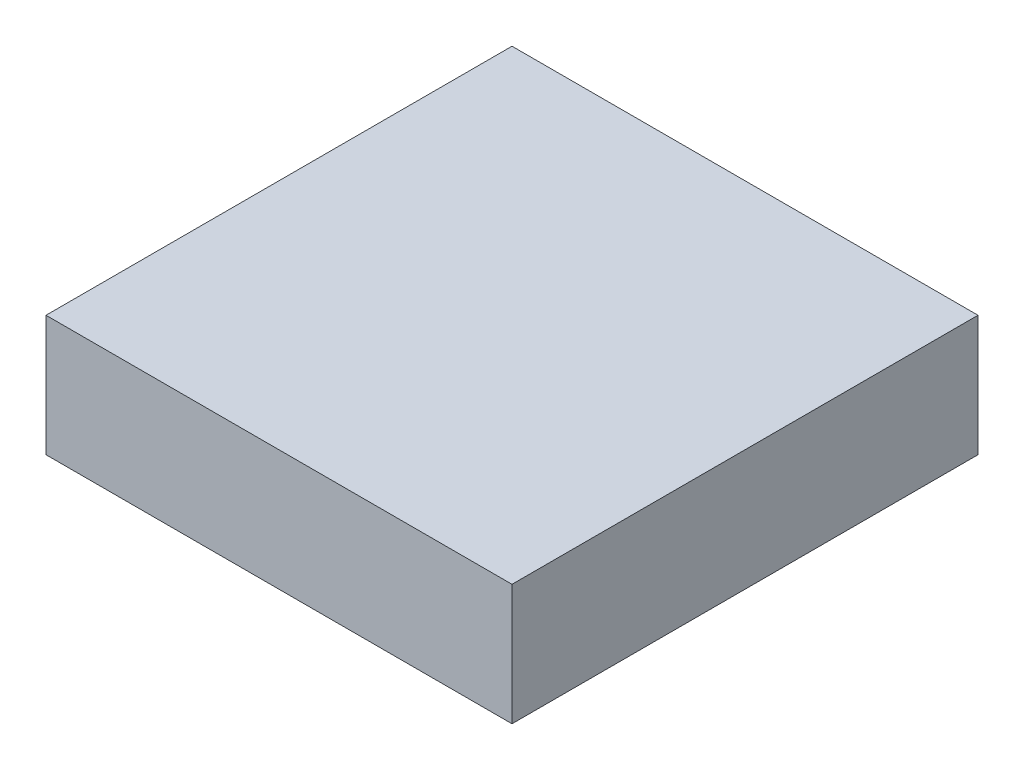
ISO-10303-21;
HEADER;
FILE_DESCRIPTION(('STEP AP214'),'2;1');
FILE_NAME('part.step','',(''),(''),'','','');
FILE_SCHEMA(('AUTOMOTIVE_DESIGN { 1 0 10303 214 1 1 1 1 }'));
ENDSEC;
DATA;
#1=APPLICATION_CONTEXT('core data for automotive mechanical design processes');
#2=APPLICATION_PROTOCOL_DEFINITION('international standard','automotive_design',2000,#1);
#3=PRODUCT_CONTEXT('',#1,'mechanical');
#4=PRODUCT('Part','Part','',(#3));
#5=PRODUCT_RELATED_PRODUCT_CATEGORY('part','',(#4));
#6=PRODUCT_DEFINITION_FORMATION('','',#4);
#7=PRODUCT_DEFINITION_CONTEXT('part definition',#1,'design');
#8=PRODUCT_DEFINITION('design','',#6,#7);
#9=PRODUCT_DEFINITION_SHAPE('','',#8);
#10=(LENGTH_UNIT() NAMED_UNIT(*) SI_UNIT(.MILLI.,.METRE.));
#11=(NAMED_UNIT(*) PLANE_ANGLE_UNIT() SI_UNIT($,.RADIAN.));
#12=(NAMED_UNIT(*) SI_UNIT($,.STERADIAN.) SOLID_ANGLE_UNIT());
#13=UNCERTAINTY_MEASURE_WITH_UNIT(LENGTH_MEASURE(1.E-05),#10,'distance_accuracy_value','');
#14=(GEOMETRIC_REPRESENTATION_CONTEXT(3) GLOBAL_UNCERTAINTY_ASSIGNED_CONTEXT((#13)) GLOBAL_UNIT_ASSIGNED_CONTEXT((#10,
#11,#12)) REPRESENTATION_CONTEXT('',''));
#15=CARTESIAN_POINT('',(0.,0.,0.));
#16=DIRECTION('',(0.,0.,1.));
#17=DIRECTION('',(1.,0.,0.));
#18=AXIS2_PLACEMENT_3D('',#15,#16,#17);
#19=CARTESIAN_POINT('',(0.,7.,0.));
#20=DIRECTION('',(1.,0.,0.));
#21=DIRECTION('',(0.,0.,-1.));
#22=AXIS2_PLACEMENT_3D('',#19,#20,#21);
#23=PLANE('',#22);
#24=DIRECTION('',(0.,0.,1.));
#25=VECTOR('',#24,1.);
#26=CARTESIAN_POINT('',(0.,0.,0.));
#27=LINE('',#26,#25);
#28=CARTESIAN_POINT('',(0.,0.,-27.));
#29=VERTEX_POINT('',#28);
#30=CARTESIAN_POINT('',(0.,0.,0.));
#31=VERTEX_POINT('',#30);
#32=EDGE_CURVE('E97',#29,#31,#27,.T.);
#33=ORIENTED_EDGE('',*,*,#32,.T.);
#34=DIRECTION('',(0.,-1.,0.));
#35=VECTOR('',#34,1.);
#36=CARTESIAN_POINT('',(0.,7.,0.));
#37=LINE('',#36,#35);
#38=CARTESIAN_POINT('',(0.,7.,0.));
#39=VERTEX_POINT('',#38);
#40=EDGE_CURVE('E11',#39,#31,#37,.T.);
#41=ORIENTED_EDGE('',*,*,#40,.F.);
#42=DIRECTION('',(0.,0.,1.));
#43=VECTOR('',#42,1.);
#44=CARTESIAN_POINT('',(0.,7.,0.));
#45=LINE('',#44,#43);
#46=CARTESIAN_POINT('',(0.,7.,-27.));
#47=VERTEX_POINT('',#46);
#48=EDGE_CURVE('E85',#47,#39,#45,.T.);
#49=ORIENTED_EDGE('',*,*,#48,.F.);
#50=DIRECTION('',(0.,-1.,0.));
#51=VECTOR('',#50,1.);
#52=CARTESIAN_POINT('',(0.,7.,-27.));
#53=LINE('',#52,#51);
#54=EDGE_CURVE('E93',#47,#29,#53,.T.);
#55=ORIENTED_EDGE('',*,*,#54,.T.);
#56=EDGE_LOOP('',(#33,#41,#49,#55));
#57=FACE_BOUND('',#56,.T.);
#58=ADVANCED_FACE('F34',(#57),#23,.F.);
#59=CARTESIAN_POINT('',(0.,7.,0.));
#60=DIRECTION('',(0.,0.,-1.));
#61=DIRECTION('',(-1.,0.,0.));
#62=AXIS2_PLACEMENT_3D('',#59,#60,#61);
#63=PLANE('',#62);
#64=DIRECTION('',(1.,0.,0.));
#65=VECTOR('',#64,1.);
#66=CARTESIAN_POINT('',(0.,0.,0.));
#67=LINE('',#66,#65);
#68=CARTESIAN_POINT('',(27.,0.,0.));
#69=VERTEX_POINT('',#68);
#70=EDGE_CURVE('E89',#31,#69,#67,.T.);
#71=ORIENTED_EDGE('',*,*,#70,.T.);
#72=DIRECTION('',(0.,-1.,0.));
#73=VECTOR('',#72,1.);
#74=CARTESIAN_POINT('',(27.,7.,0.));
#75=LINE('',#74,#73);
#76=CARTESIAN_POINT('',(27.,7.,0.));
#77=VERTEX_POINT('',#76);
#78=EDGE_CURVE('E42',#77,#69,#75,.T.);
#79=ORIENTED_EDGE('',*,*,#78,.F.);
#80=DIRECTION('',(1.,0.,0.));
#81=VECTOR('',#80,1.);
#82=CARTESIAN_POINT('',(0.,7.,0.));
#83=LINE('',#82,#81);
#84=EDGE_CURVE('E80',#39,#77,#83,.T.);
#85=ORIENTED_EDGE('',*,*,#84,.F.);
#86=ORIENTED_EDGE('',*,*,#40,.T.);
#87=EDGE_LOOP('',(#71,#79,#85,#86));
#88=FACE_BOUND('',#87,.T.);
#89=ADVANCED_FACE('F88',(#88),#63,.F.);
#90=CARTESIAN_POINT('',(27.,7.,0.));
#91=DIRECTION('',(-1.,0.,0.));
#92=DIRECTION('',(0.,0.,1.));
#93=AXIS2_PLACEMENT_3D('',#90,#91,#92);
#94=PLANE('',#93);
#95=DIRECTION('',(0.,0.,-1.));
#96=VECTOR('',#95,1.);
#97=CARTESIAN_POINT('',(27.,0.,0.));
#98=LINE('',#97,#96);
#99=CARTESIAN_POINT('',(27.,0.,-27.));
#100=VERTEX_POINT('',#99);
#101=EDGE_CURVE('E67',#69,#100,#98,.T.);
#102=ORIENTED_EDGE('',*,*,#101,.T.);
#103=DIRECTION('',(0.,-1.,0.));
#104=VECTOR('',#103,1.);
#105=CARTESIAN_POINT('',(27.,7.,-27.));
#106=LINE('',#105,#104);
#107=CARTESIAN_POINT('',(27.,7.,-27.));
#108=VERTEX_POINT('',#107);
#109=EDGE_CURVE('E90',#108,#100,#106,.T.);
#110=ORIENTED_EDGE('',*,*,#109,.F.);
#111=DIRECTION('',(0.,0.,-1.));
#112=VECTOR('',#111,1.);
#113=CARTESIAN_POINT('',(27.,7.,0.));
#114=LINE('',#113,#112);
#115=EDGE_CURVE('E83',#77,#108,#114,.T.);
#116=ORIENTED_EDGE('',*,*,#115,.F.);
#117=ORIENTED_EDGE('',*,*,#78,.T.);
#118=EDGE_LOOP('',(#102,#110,#116,#117));
#119=FACE_BOUND('',#118,.T.);
#120=ADVANCED_FACE('F91',(#119),#94,.F.);
#121=CARTESIAN_POINT('',(0.,7.,-27.));
#122=DIRECTION('',(0.,0.,1.));
#123=DIRECTION('',(1.,0.,0.));
#124=AXIS2_PLACEMENT_3D('',#121,#122,#123);
#125=PLANE('',#124);
#126=DIRECTION('',(-1.,0.,0.));
#127=VECTOR('',#126,1.);
#128=CARTESIAN_POINT('',(0.,0.,-27.));
#129=LINE('',#128,#127);
#130=EDGE_CURVE('E73',#100,#29,#129,.T.);
#131=ORIENTED_EDGE('',*,*,#130,.T.);
#132=ORIENTED_EDGE('',*,*,#54,.F.);
#133=DIRECTION('',(-1.,0.,0.));
#134=VECTOR('',#133,1.);
#135=CARTESIAN_POINT('',(0.,7.,-27.));
#136=LINE('',#135,#134);
#137=EDGE_CURVE('E50',#108,#47,#136,.T.);
#138=ORIENTED_EDGE('',*,*,#137,.F.);
#139=ORIENTED_EDGE('',*,*,#109,.T.);
#140=EDGE_LOOP('',(#131,#132,#138,#139));
#141=FACE_BOUND('',#140,.T.);
#142=ADVANCED_FACE('F104',(#141),#125,.F.);
#143=CARTESIAN_POINT('',(0.,7.,0.));
#144=DIRECTION('',(0.,-1.,0.));
#145=DIRECTION('',(0.,0.,-1.));
#146=AXIS2_PLACEMENT_3D('',#143,#144,#145);
#147=PLANE('',#146);
#148=ORIENTED_EDGE('',*,*,#48,.T.);
#149=ORIENTED_EDGE('',*,*,#84,.T.);
#150=ORIENTED_EDGE('',*,*,#115,.T.);
#151=ORIENTED_EDGE('',*,*,#137,.T.);
#152=EDGE_LOOP('',(#148,#149,#150,#151));
#153=FACE_BOUND('',#152,.T.);
#154=ADVANCED_FACE('F81',(#153),#147,.F.);
#155=CARTESIAN_POINT('',(0.,0.,0.));
#156=DIRECTION('',(0.,-1.,0.));
#157=DIRECTION('',(0.,0.,-1.));
#158=AXIS2_PLACEMENT_3D('',#155,#156,#157);
#159=PLANE('',#158);
#160=ORIENTED_EDGE('',*,*,#32,.F.);
#161=ORIENTED_EDGE('',*,*,#130,.F.);
#162=ORIENTED_EDGE('',*,*,#101,.F.);
#163=ORIENTED_EDGE('',*,*,#70,.F.);
#164=EDGE_LOOP('',(#160,#161,#162,#163));
#165=FACE_BOUND('',#164,.T.);
#166=ADVANCED_FACE('F107',(#165),#159,.T.);
#167=CLOSED_SHELL('',(#58,#89,#120,#142,#154,#166));
#168=MANIFOLD_SOLID_BREP('B2',#167);
#169=ADVANCED_BREP_SHAPE_REPRESENTATION('',(#18,#168),#14);
#170=SHAPE_DEFINITION_REPRESENTATION(#9,#169);
ENDSEC;
END-ISO-10303-21;
